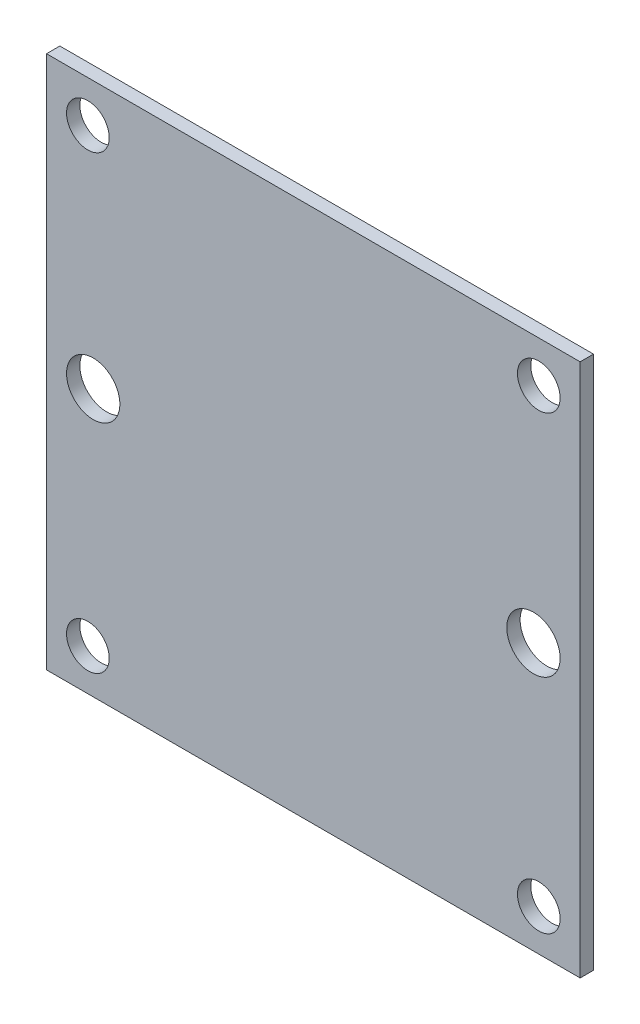
ISO-10303-21;
HEADER;
FILE_DESCRIPTION(('STEP AP214'),'2;1');
FILE_NAME('part.step','',(''),(''),'','','');
FILE_SCHEMA(('AUTOMOTIVE_DESIGN { 1 0 10303 214 1 1 1 1 }'));
ENDSEC;
DATA;
#1=APPLICATION_CONTEXT('core data for automotive mechanical design processes');
#2=APPLICATION_PROTOCOL_DEFINITION('international standard','automotive_design',2000,#1);
#3=PRODUCT_CONTEXT('',#1,'mechanical');
#4=PRODUCT('Part','Part','',(#3));
#5=PRODUCT_RELATED_PRODUCT_CATEGORY('part','',(#4));
#6=PRODUCT_DEFINITION_FORMATION('','',#4);
#7=PRODUCT_DEFINITION_CONTEXT('part definition',#1,'design');
#8=PRODUCT_DEFINITION('design','',#6,#7);
#9=PRODUCT_DEFINITION_SHAPE('','',#8);
#10=(LENGTH_UNIT() NAMED_UNIT(*) SI_UNIT(.MILLI.,.METRE.));
#11=(NAMED_UNIT(*) PLANE_ANGLE_UNIT() SI_UNIT($,.RADIAN.));
#12=(NAMED_UNIT(*) SI_UNIT($,.STERADIAN.) SOLID_ANGLE_UNIT());
#13=UNCERTAINTY_MEASURE_WITH_UNIT(LENGTH_MEASURE(1.E-05),#10,'distance_accuracy_value','');
#14=(GEOMETRIC_REPRESENTATION_CONTEXT(3) GLOBAL_UNCERTAINTY_ASSIGNED_CONTEXT((#13)) GLOBAL_UNIT_ASSIGNED_CONTEXT((#10,
#11,#12)) REPRESENTATION_CONTEXT('',''));
#15=CARTESIAN_POINT('',(0.,0.,0.));
#16=DIRECTION('',(0.,0.,1.));
#17=DIRECTION('',(1.,0.,0.));
#18=AXIS2_PLACEMENT_3D('',#15,#16,#17);
#19=CARTESIAN_POINT('',(20.,20.,1.));
#20=DIRECTION('',(-1.,0.,0.));
#21=DIRECTION('',(0.,0.,1.));
#22=AXIS2_PLACEMENT_3D('',#19,#20,#21);
#23=PLANE('',#22);
#24=DIRECTION('',(0.,1.,0.));
#25=VECTOR('',#24,1.);
#26=CARTESIAN_POINT('',(20.,20.,0.));
#27=LINE('',#26,#25);
#28=CARTESIAN_POINT('',(20.,-20.,0.));
#29=VERTEX_POINT('',#28);
#30=CARTESIAN_POINT('',(20.,20.,0.));
#31=VERTEX_POINT('',#30);
#32=EDGE_CURVE('E99',#29,#31,#27,.T.);
#33=ORIENTED_EDGE('',*,*,#32,.T.);
#34=DIRECTION('',(0.,0.,-1.));
#35=VECTOR('',#34,1.);
#36=CARTESIAN_POINT('',(20.,20.,1.));
#37=LINE('',#36,#35);
#38=CARTESIAN_POINT('',(20.,20.,1.));
#39=VERTEX_POINT('',#38);
#40=EDGE_CURVE('E11',#39,#31,#37,.T.);
#41=ORIENTED_EDGE('',*,*,#40,.F.);
#42=DIRECTION('',(0.,1.,0.));
#43=VECTOR('',#42,1.);
#44=CARTESIAN_POINT('',(20.,20.,1.));
#45=LINE('',#44,#43);
#46=CARTESIAN_POINT('',(20.,-20.,1.));
#47=VERTEX_POINT('',#46);
#48=EDGE_CURVE('E86',#47,#39,#45,.T.);
#49=ORIENTED_EDGE('',*,*,#48,.F.);
#50=DIRECTION('',(0.,0.,-1.));
#51=VECTOR('',#50,1.);
#52=CARTESIAN_POINT('',(20.,-20.,1.));
#53=LINE('',#52,#51);
#54=EDGE_CURVE('E95',#47,#29,#53,.T.);
#55=ORIENTED_EDGE('',*,*,#54,.T.);
#56=EDGE_LOOP('',(#33,#41,#49,#55));
#57=FACE_BOUND('',#56,.T.);
#58=ADVANCED_FACE('F33',(#57),#23,.F.);
#59=CARTESIAN_POINT('',(-20.,20.,1.));
#60=DIRECTION('',(0.,-1.,0.));
#61=DIRECTION('',(0.,0.,-1.));
#62=AXIS2_PLACEMENT_3D('',#59,#60,#61);
#63=PLANE('',#62);
#64=DIRECTION('',(-1.,0.,0.));
#65=VECTOR('',#64,1.);
#66=CARTESIAN_POINT('',(-20.,20.,0.));
#67=LINE('',#66,#65);
#68=CARTESIAN_POINT('',(-20.,20.,0.));
#69=VERTEX_POINT('',#68);
#70=EDGE_CURVE('E90',#31,#69,#67,.T.);
#71=ORIENTED_EDGE('',*,*,#70,.T.);
#72=DIRECTION('',(0.,0.,-1.));
#73=VECTOR('',#72,1.);
#74=CARTESIAN_POINT('',(-20.,20.,1.));
#75=LINE('',#74,#73);
#76=CARTESIAN_POINT('',(-20.,20.,1.));
#77=VERTEX_POINT('',#76);
#78=EDGE_CURVE('E42',#77,#69,#75,.T.);
#79=ORIENTED_EDGE('',*,*,#78,.F.);
#80=DIRECTION('',(-1.,0.,0.));
#81=VECTOR('',#80,1.);
#82=CARTESIAN_POINT('',(-20.,20.,1.));
#83=LINE('',#82,#81);
#84=EDGE_CURVE('E81',#39,#77,#83,.T.);
#85=ORIENTED_EDGE('',*,*,#84,.F.);
#86=ORIENTED_EDGE('',*,*,#40,.T.);
#87=EDGE_LOOP('',(#71,#79,#85,#86));
#88=FACE_BOUND('',#87,.T.);
#89=ADVANCED_FACE('F89',(#88),#63,.F.);
#90=CARTESIAN_POINT('',(-20.,20.,1.));
#91=DIRECTION('',(1.,0.,0.));
#92=DIRECTION('',(0.,1.,0.));
#93=AXIS2_PLACEMENT_3D('',#90,#91,#92);
#94=PLANE('',#93);
#95=DIRECTION('',(0.,-1.,0.));
#96=VECTOR('',#95,1.);
#97=CARTESIAN_POINT('',(-20.,20.,0.));
#98=LINE('',#97,#96);
#99=CARTESIAN_POINT('',(-20.,-20.,0.));
#100=VERTEX_POINT('',#99);
#101=EDGE_CURVE('E68',#69,#100,#98,.T.);
#102=ORIENTED_EDGE('',*,*,#101,.T.);
#103=DIRECTION('',(0.,0.,-1.));
#104=VECTOR('',#103,1.);
#105=CARTESIAN_POINT('',(-20.,-20.,1.));
#106=LINE('',#105,#104);
#107=CARTESIAN_POINT('',(-20.,-20.,1.));
#108=VERTEX_POINT('',#107);
#109=EDGE_CURVE('E91',#108,#100,#106,.T.);
#110=ORIENTED_EDGE('',*,*,#109,.F.);
#111=DIRECTION('',(0.,-1.,0.));
#112=VECTOR('',#111,1.);
#113=CARTESIAN_POINT('',(-20.,20.,1.));
#114=LINE('',#113,#112);
#115=EDGE_CURVE('E84',#77,#108,#114,.T.);
#116=ORIENTED_EDGE('',*,*,#115,.F.);
#117=ORIENTED_EDGE('',*,*,#78,.T.);
#118=EDGE_LOOP('',(#102,#110,#116,#117));
#119=FACE_BOUND('',#118,.T.);
#120=ADVANCED_FACE('F93',(#119),#94,.F.);
#121=CARTESIAN_POINT('',(-20.,-20.,1.));
#122=DIRECTION('',(0.,1.,0.));
#123=DIRECTION('',(0.,0.,1.));
#124=AXIS2_PLACEMENT_3D('',#121,#122,#123);
#125=PLANE('',#124);
#126=DIRECTION('',(1.,0.,0.));
#127=VECTOR('',#126,1.);
#128=CARTESIAN_POINT('',(-20.,-20.,0.));
#129=LINE('',#128,#127);
#130=EDGE_CURVE('E74',#100,#29,#129,.T.);
#131=ORIENTED_EDGE('',*,*,#130,.T.);
#132=ORIENTED_EDGE('',*,*,#54,.F.);
#133=DIRECTION('',(1.,0.,0.));
#134=VECTOR('',#133,1.);
#135=CARTESIAN_POINT('',(-20.,-20.,1.));
#136=LINE('',#135,#134);
#137=EDGE_CURVE('E51',#108,#47,#136,.T.);
#138=ORIENTED_EDGE('',*,*,#137,.F.);
#139=ORIENTED_EDGE('',*,*,#109,.T.);
#140=EDGE_LOOP('',(#131,#132,#138,#139));
#141=FACE_BOUND('',#140,.T.);
#142=ADVANCED_FACE('F149',(#141),#125,.F.);
#143=CARTESIAN_POINT('',(0.,0.,1.));
#144=DIRECTION('',(0.,0.,1.));
#145=DIRECTION('',(1.,0.,0.));
#146=AXIS2_PLACEMENT_3D('',#143,#144,#145);
#147=PLANE('',#146);
#148=CARTESIAN_POINT('',(-16.5,0.,1.));
#149=DIRECTION('',(0.,0.,1.));
#150=DIRECTION('',(1.,0.,0.));
#151=AXIS2_PLACEMENT_3D('',#148,#149,#150);
#152=CIRCLE('',#151,2.);
#153=CARTESIAN_POINT('',(-14.5,0.,1.));
#154=VERTEX_POINT('',#153);
#155=EDGE_CURVE('E134',#154,#154,#152,.T.);
#156=ORIENTED_EDGE('',*,*,#155,.F.);
#157=EDGE_LOOP('',(#156));
#158=FACE_BOUND('',#157,.T.);
#159=CARTESIAN_POINT('',(16.5,0.,1.));
#160=DIRECTION('',(0.,0.,1.));
#161=DIRECTION('',(1.,0.,0.));
#162=AXIS2_PLACEMENT_3D('',#159,#160,#161);
#163=CIRCLE('',#162,2.);
#164=CARTESIAN_POINT('',(18.5,0.,1.));
#165=VERTEX_POINT('',#164);
#166=EDGE_CURVE('E124',#165,#165,#163,.T.);
#167=ORIENTED_EDGE('',*,*,#166,.F.);
#168=EDGE_LOOP('',(#167));
#169=FACE_BOUND('',#168,.T.);
#170=CARTESIAN_POINT('',(-16.9,16.9,1.));
#171=DIRECTION('',(0.,0.,1.));
#172=DIRECTION('',(1.,0.,0.));
#173=AXIS2_PLACEMENT_3D('',#170,#171,#172);
#174=CIRCLE('',#173,1.6);
#175=CARTESIAN_POINT('',(-15.3,16.9,1.));
#176=VERTEX_POINT('',#175);
#177=EDGE_CURVE('E121',#176,#176,#174,.T.);
#178=ORIENTED_EDGE('',*,*,#177,.F.);
#179=EDGE_LOOP('',(#178));
#180=FACE_BOUND('',#179,.T.);
#181=CARTESIAN_POINT('',(16.9,16.9,1.));
#182=DIRECTION('',(0.,0.,1.));
#183=DIRECTION('',(1.,0.,0.));
#184=AXIS2_PLACEMENT_3D('',#181,#182,#183);
#185=CIRCLE('',#184,1.6);
#186=CARTESIAN_POINT('',(18.5,16.9,1.));
#187=VERTEX_POINT('',#186);
#188=EDGE_CURVE('E118',#187,#187,#185,.T.);
#189=ORIENTED_EDGE('',*,*,#188,.F.);
#190=EDGE_LOOP('',(#189));
#191=FACE_BOUND('',#190,.T.);
#192=CARTESIAN_POINT('',(16.9,-16.9,1.));
#193=DIRECTION('',(0.,0.,1.));
#194=DIRECTION('',(1.,0.,0.));
#195=AXIS2_PLACEMENT_3D('',#192,#193,#194);
#196=CIRCLE('',#195,1.6);
#197=CARTESIAN_POINT('',(18.5,-16.9,1.));
#198=VERTEX_POINT('',#197);
#199=EDGE_CURVE('E114',#198,#198,#196,.T.);
#200=ORIENTED_EDGE('',*,*,#199,.F.);
#201=EDGE_LOOP('',(#200));
#202=FACE_BOUND('',#201,.T.);
#203=CARTESIAN_POINT('',(-16.9,-16.9,1.));
#204=DIRECTION('',(0.,0.,1.));
#205=DIRECTION('',(1.,0.,0.));
#206=AXIS2_PLACEMENT_3D('',#203,#204,#205);
#207=CIRCLE('',#206,1.6);
#208=CARTESIAN_POINT('',(-15.3,-16.9,1.));
#209=VERTEX_POINT('',#208);
#210=EDGE_CURVE('E110',#209,#209,#207,.T.);
#211=ORIENTED_EDGE('',*,*,#210,.F.);
#212=EDGE_LOOP('',(#211));
#213=FACE_BOUND('',#212,.T.);
#214=ORIENTED_EDGE('',*,*,#48,.T.);
#215=ORIENTED_EDGE('',*,*,#84,.T.);
#216=ORIENTED_EDGE('',*,*,#115,.T.);
#217=ORIENTED_EDGE('',*,*,#137,.T.);
#218=EDGE_LOOP('',(#214,#215,#216,#217));
#219=FACE_BOUND('',#218,.T.);
#220=ADVANCED_FACE('F82',(#158,#169,#180,#191,#202,#213,#219),#147,.T.);
#221=CARTESIAN_POINT('',(0.,0.,0.));
#222=DIRECTION('',(0.,0.,1.));
#223=DIRECTION('',(1.,0.,0.));
#224=AXIS2_PLACEMENT_3D('',#221,#222,#223);
#225=PLANE('',#224);
#226=CARTESIAN_POINT('',(-16.5,0.,0.));
#227=DIRECTION('',(0.,0.,1.));
#228=DIRECTION('',(1.,0.,0.));
#229=AXIS2_PLACEMENT_3D('',#226,#227,#228);
#230=CIRCLE('',#229,2.);
#231=CARTESIAN_POINT('',(-14.5,0.,0.));
#232=VERTEX_POINT('',#231);
#233=EDGE_CURVE('E36',#232,#232,#230,.T.);
#234=ORIENTED_EDGE('',*,*,#233,.T.);
#235=EDGE_LOOP('',(#234));
#236=FACE_BOUND('',#235,.T.);
#237=CARTESIAN_POINT('',(16.5,0.,0.));
#238=DIRECTION('',(0.,0.,1.));
#239=DIRECTION('',(1.,0.,0.));
#240=AXIS2_PLACEMENT_3D('',#237,#238,#239);
#241=CIRCLE('',#240,2.);
#242=CARTESIAN_POINT('',(18.5,0.,0.));
#243=VERTEX_POINT('',#242);
#244=EDGE_CURVE('E122',#243,#243,#241,.T.);
#245=ORIENTED_EDGE('',*,*,#244,.T.);
#246=EDGE_LOOP('',(#245));
#247=FACE_BOUND('',#246,.T.);
#248=CARTESIAN_POINT('',(-16.9,16.9,0.));
#249=DIRECTION('',(0.,0.,1.));
#250=DIRECTION('',(1.,0.,0.));
#251=AXIS2_PLACEMENT_3D('',#248,#249,#250);
#252=CIRCLE('',#251,1.6);
#253=CARTESIAN_POINT('',(-15.3,16.9,0.));
#254=VERTEX_POINT('',#253);
#255=EDGE_CURVE('E119',#254,#254,#252,.T.);
#256=ORIENTED_EDGE('',*,*,#255,.T.);
#257=EDGE_LOOP('',(#256));
#258=FACE_BOUND('',#257,.T.);
#259=CARTESIAN_POINT('',(16.9,16.9,0.));
#260=DIRECTION('',(0.,0.,1.));
#261=DIRECTION('',(1.,0.,0.));
#262=AXIS2_PLACEMENT_3D('',#259,#260,#261);
#263=CIRCLE('',#262,1.6);
#264=CARTESIAN_POINT('',(18.5,16.9,0.));
#265=VERTEX_POINT('',#264);
#266=EDGE_CURVE('E115',#265,#265,#263,.T.);
#267=ORIENTED_EDGE('',*,*,#266,.T.);
#268=EDGE_LOOP('',(#267));
#269=FACE_BOUND('',#268,.T.);
#270=CARTESIAN_POINT('',(16.9,-16.9,0.));
#271=DIRECTION('',(0.,0.,1.));
#272=DIRECTION('',(1.,0.,0.));
#273=AXIS2_PLACEMENT_3D('',#270,#271,#272);
#274=CIRCLE('',#273,1.6);
#275=CARTESIAN_POINT('',(18.5,-16.9,0.));
#276=VERTEX_POINT('',#275);
#277=EDGE_CURVE('E111',#276,#276,#274,.T.);
#278=ORIENTED_EDGE('',*,*,#277,.T.);
#279=EDGE_LOOP('',(#278));
#280=FACE_BOUND('',#279,.T.);
#281=CARTESIAN_POINT('',(-16.9,-16.9,0.));
#282=DIRECTION('',(0.,0.,1.));
#283=DIRECTION('',(1.,0.,0.));
#284=AXIS2_PLACEMENT_3D('',#281,#282,#283);
#285=CIRCLE('',#284,1.6);
#286=CARTESIAN_POINT('',(-15.3,-16.9,0.));
#287=VERTEX_POINT('',#286);
#288=EDGE_CURVE('E102',#287,#287,#285,.T.);
#289=ORIENTED_EDGE('',*,*,#288,.T.);
#290=EDGE_LOOP('',(#289));
#291=FACE_BOUND('',#290,.T.);
#292=ORIENTED_EDGE('',*,*,#32,.F.);
#293=ORIENTED_EDGE('',*,*,#130,.F.);
#294=ORIENTED_EDGE('',*,*,#101,.F.);
#295=ORIENTED_EDGE('',*,*,#70,.F.);
#296=EDGE_LOOP('',(#292,#293,#294,#295));
#297=FACE_BOUND('',#296,.T.);
#298=ADVANCED_FACE('F148',(#236,#247,#258,#269,#280,#291,#297),#225,.F.);
#299=CARTESIAN_POINT('',(-16.9,-16.9,-9.));
#300=DIRECTION('',(0.,0.,1.));
#301=DIRECTION('',(1.,0.,0.));
#302=AXIS2_PLACEMENT_3D('',#299,#300,#301);
#303=CYLINDRICAL_SURFACE('',#302,1.6);
#304=ORIENTED_EDGE('',*,*,#210,.T.);
#305=EDGE_LOOP('',(#304));
#306=FACE_BOUND('',#305,.T.);
#307=ORIENTED_EDGE('',*,*,#288,.F.);
#308=EDGE_LOOP('',(#307));
#309=FACE_BOUND('',#308,.T.);
#310=ADVANCED_FACE('F144',(#306,#309),#303,.F.);
#311=CARTESIAN_POINT('',(16.9,-16.9,-9.));
#312=DIRECTION('',(0.,0.,1.));
#313=DIRECTION('',(1.,0.,0.));
#314=AXIS2_PLACEMENT_3D('',#311,#312,#313);
#315=CYLINDRICAL_SURFACE('',#314,1.6);
#316=ORIENTED_EDGE('',*,*,#199,.T.);
#317=EDGE_LOOP('',(#316));
#318=FACE_BOUND('',#317,.T.);
#319=ORIENTED_EDGE('',*,*,#277,.F.);
#320=EDGE_LOOP('',(#319));
#321=FACE_BOUND('',#320,.T.);
#322=ADVANCED_FACE('F196',(#318,#321),#315,.F.);
#323=CARTESIAN_POINT('',(16.9,16.9,-9.));
#324=DIRECTION('',(0.,0.,1.));
#325=DIRECTION('',(1.,0.,0.));
#326=AXIS2_PLACEMENT_3D('',#323,#324,#325);
#327=CYLINDRICAL_SURFACE('',#326,1.6);
#328=ORIENTED_EDGE('',*,*,#188,.T.);
#329=EDGE_LOOP('',(#328));
#330=FACE_BOUND('',#329,.T.);
#331=ORIENTED_EDGE('',*,*,#266,.F.);
#332=EDGE_LOOP('',(#331));
#333=FACE_BOUND('',#332,.T.);
#334=ADVANCED_FACE('F201',(#330,#333),#327,.F.);
#335=CARTESIAN_POINT('',(-16.9,16.9,-9.));
#336=DIRECTION('',(0.,0.,1.));
#337=DIRECTION('',(1.,0.,0.));
#338=AXIS2_PLACEMENT_3D('',#335,#336,#337);
#339=CYLINDRICAL_SURFACE('',#338,1.6);
#340=ORIENTED_EDGE('',*,*,#177,.T.);
#341=EDGE_LOOP('',(#340));
#342=FACE_BOUND('',#341,.T.);
#343=ORIENTED_EDGE('',*,*,#255,.F.);
#344=EDGE_LOOP('',(#343));
#345=FACE_BOUND('',#344,.T.);
#346=ADVANCED_FACE('F209',(#342,#345),#339,.F.);
#347=CARTESIAN_POINT('',(16.5,0.,-9.));
#348=DIRECTION('',(0.,0.,1.));
#349=DIRECTION('',(1.,0.,0.));
#350=AXIS2_PLACEMENT_3D('',#347,#348,#349);
#351=CYLINDRICAL_SURFACE('',#350,2.);
#352=ORIENTED_EDGE('',*,*,#166,.T.);
#353=EDGE_LOOP('',(#352));
#354=FACE_BOUND('',#353,.T.);
#355=ORIENTED_EDGE('',*,*,#244,.F.);
#356=EDGE_LOOP('',(#355));
#357=FACE_BOUND('',#356,.T.);
#358=ADVANCED_FACE('F217',(#354,#357),#351,.F.);
#359=CARTESIAN_POINT('',(-16.5,0.,-9.));
#360=DIRECTION('',(0.,0.,1.));
#361=DIRECTION('',(1.,0.,0.));
#362=AXIS2_PLACEMENT_3D('',#359,#360,#361);
#363=CYLINDRICAL_SURFACE('',#362,2.);
#364=ORIENTED_EDGE('',*,*,#155,.T.);
#365=EDGE_LOOP('',(#364));
#366=FACE_BOUND('',#365,.T.);
#367=ORIENTED_EDGE('',*,*,#233,.F.);
#368=EDGE_LOOP('',(#367));
#369=FACE_BOUND('',#368,.T.);
#370=ADVANCED_FACE('F225',(#366,#369),#363,.F.);
#371=CLOSED_SHELL('',(#58,#89,#120,#142,#220,#298,#310,#322,#334,#346,#358,#370));
#372=MANIFOLD_SOLID_BREP('B2',#371);
#373=ADVANCED_BREP_SHAPE_REPRESENTATION('',(#18,#372),#14);
#374=SHAPE_DEFINITION_REPRESENTATION(#9,#373);
ENDSEC;
END-ISO-10303-21;
